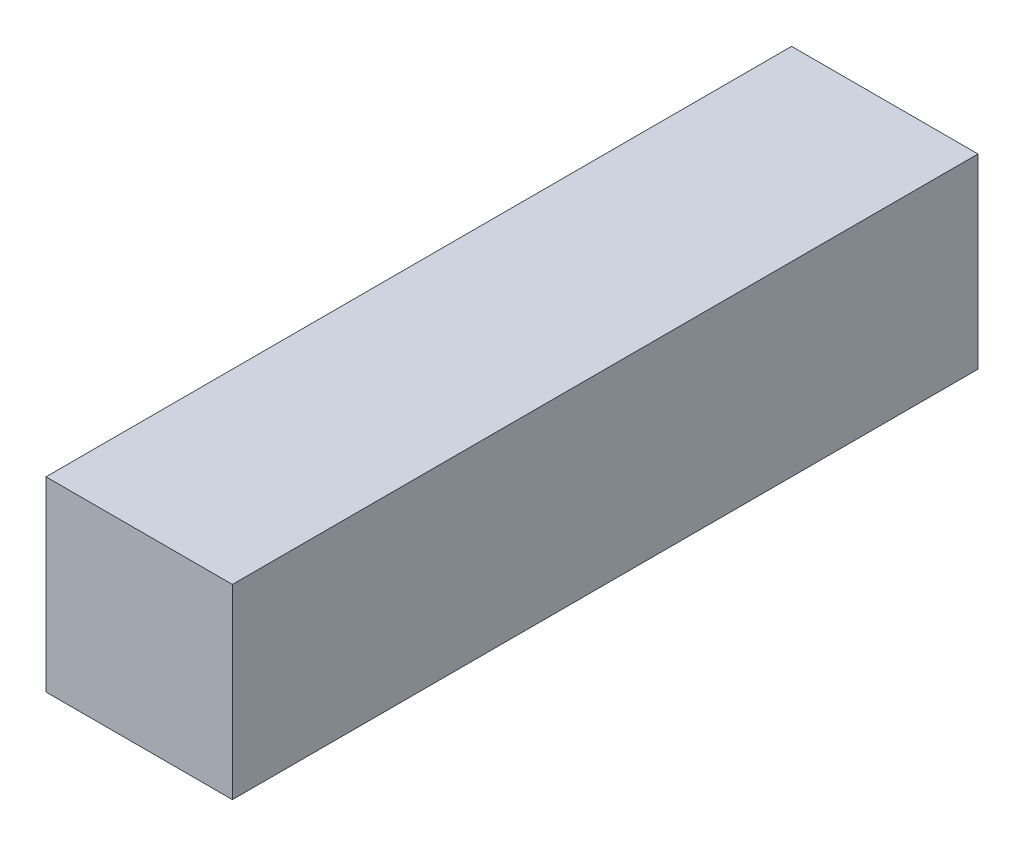
ISO-10303-21;
HEADER;
FILE_DESCRIPTION(('STEP AP214'),'2;1');
FILE_NAME('part.step','',(''),(''),'','','');
FILE_SCHEMA(('AUTOMOTIVE_DESIGN { 1 0 10303 214 1 1 1 1 }'));
ENDSEC;
DATA;
#1=APPLICATION_CONTEXT('core data for automotive mechanical design processes');
#2=APPLICATION_PROTOCOL_DEFINITION('international standard','automotive_design',2000,#1);
#3=PRODUCT_CONTEXT('',#1,'mechanical');
#4=PRODUCT('Part','Part','',(#3));
#5=PRODUCT_RELATED_PRODUCT_CATEGORY('part','',(#4));
#6=PRODUCT_DEFINITION_FORMATION('','',#4);
#7=PRODUCT_DEFINITION_CONTEXT('part definition',#1,'design');
#8=PRODUCT_DEFINITION('design','',#6,#7);
#9=PRODUCT_DEFINITION_SHAPE('','',#8);
#10=(LENGTH_UNIT() NAMED_UNIT(*) SI_UNIT(.MILLI.,.METRE.));
#11=(NAMED_UNIT(*) PLANE_ANGLE_UNIT() SI_UNIT($,.RADIAN.));
#12=(NAMED_UNIT(*) SI_UNIT($,.STERADIAN.) SOLID_ANGLE_UNIT());
#13=UNCERTAINTY_MEASURE_WITH_UNIT(LENGTH_MEASURE(1.E-05),#10,'distance_accuracy_value','');
#14=(GEOMETRIC_REPRESENTATION_CONTEXT(3) GLOBAL_UNCERTAINTY_ASSIGNED_CONTEXT((#13)) GLOBAL_UNIT_ASSIGNED_CONTEXT((#10,
#11,#12)) REPRESENTATION_CONTEXT('',''));
#15=CARTESIAN_POINT('',(0.,0.,0.));
#16=DIRECTION('',(0.,0.,1.));
#17=DIRECTION('',(1.,0.,0.));
#18=AXIS2_PLACEMENT_3D('',#15,#16,#17);
#19=CARTESIAN_POINT('',(-2500.,5000.,-10000.));
#20=DIRECTION('',(0.,0.,-1.));
#21=DIRECTION('',(-1.,0.,0.));
#22=AXIS2_PLACEMENT_3D('',#19,#20,#21);
#23=PLANE('',#22);
#24=DIRECTION('',(1.,0.,0.));
#25=VECTOR('',#24,1.);
#26=CARTESIAN_POINT('',(-2500.,0.,-10000.));
#27=LINE('',#26,#25);
#28=CARTESIAN_POINT('',(-2500.,0.,-10000.));
#29=VERTEX_POINT('',#28);
#30=CARTESIAN_POINT('',(2500.,0.,-10000.));
#31=VERTEX_POINT('',#30);
#32=EDGE_CURVE('E97',#29,#31,#27,.T.);
#33=ORIENTED_EDGE('',*,*,#32,.F.);
#34=DIRECTION('',(0.,-1.,0.));
#35=VECTOR('',#34,1.);
#36=CARTESIAN_POINT('',(-2500.,5000.,-10000.));
#37=LINE('',#36,#35);
#38=CARTESIAN_POINT('',(-2500.,5000.,-10000.));
#39=VERTEX_POINT('',#38);
#40=EDGE_CURVE('E11',#39,#29,#37,.T.);
#41=ORIENTED_EDGE('',*,*,#40,.F.);
#42=DIRECTION('',(1.,0.,0.));
#43=VECTOR('',#42,1.);
#44=CARTESIAN_POINT('',(-2500.,5000.,-10000.));
#45=LINE('',#44,#43);
#46=CARTESIAN_POINT('',(2500.,5000.,-10000.));
#47=VERTEX_POINT('',#46);
#48=EDGE_CURVE('E91',#39,#47,#45,.T.);
#49=ORIENTED_EDGE('',*,*,#48,.T.);
#50=DIRECTION('',(0.,-1.,0.));
#51=VECTOR('',#50,1.);
#52=CARTESIAN_POINT('',(2500.,5000.,-10000.));
#53=LINE('',#52,#51);
#54=EDGE_CURVE('E36',#47,#31,#53,.T.);
#55=ORIENTED_EDGE('',*,*,#54,.T.);
#56=EDGE_LOOP('',(#33,#41,#49,#55));
#57=FACE_BOUND('',#56,.T.);
#58=ADVANCED_FACE('F33',(#57),#23,.T.);
#59=CARTESIAN_POINT('',(-2500.,5000.,10000.));
#60=DIRECTION('',(-1.,0.,0.));
#61=DIRECTION('',(0.,0.,1.));
#62=AXIS2_PLACEMENT_3D('',#59,#60,#61);
#63=PLANE('',#62);
#64=DIRECTION('',(0.,0.,-1.));
#65=VECTOR('',#64,1.);
#66=CARTESIAN_POINT('',(-2500.,0.,10000.));
#67=LINE('',#66,#65);
#68=CARTESIAN_POINT('',(-2500.,0.,10000.));
#69=VERTEX_POINT('',#68);
#70=EDGE_CURVE('E93',#69,#29,#67,.T.);
#71=ORIENTED_EDGE('',*,*,#70,.F.);
#72=DIRECTION('',(0.,-1.,0.));
#73=VECTOR('',#72,1.);
#74=CARTESIAN_POINT('',(-2500.,5000.,10000.));
#75=LINE('',#74,#73);
#76=CARTESIAN_POINT('',(-2500.,5000.,10000.));
#77=VERTEX_POINT('',#76);
#78=EDGE_CURVE('E42',#77,#69,#75,.T.);
#79=ORIENTED_EDGE('',*,*,#78,.F.);
#80=DIRECTION('',(0.,0.,-1.));
#81=VECTOR('',#80,1.);
#82=CARTESIAN_POINT('',(-2500.,5000.,10000.));
#83=LINE('',#82,#81);
#84=EDGE_CURVE('E81',#77,#39,#83,.T.);
#85=ORIENTED_EDGE('',*,*,#84,.T.);
#86=ORIENTED_EDGE('',*,*,#40,.T.);
#87=EDGE_LOOP('',(#71,#79,#85,#86));
#88=FACE_BOUND('',#87,.T.);
#89=ADVANCED_FACE('F107',(#88),#63,.T.);
#90=CARTESIAN_POINT('',(-2500.,5000.,10000.));
#91=DIRECTION('',(0.,0.,-1.));
#92=DIRECTION('',(-1.,0.,0.));
#93=AXIS2_PLACEMENT_3D('',#90,#91,#92);
#94=PLANE('',#93);
#95=DIRECTION('',(1.,0.,0.));
#96=VECTOR('',#95,1.);
#97=CARTESIAN_POINT('',(-2500.,0.,10000.));
#98=LINE('',#97,#96);
#99=CARTESIAN_POINT('',(2500.,0.,10000.));
#100=VERTEX_POINT('',#99);
#101=EDGE_CURVE('E86',#69,#100,#98,.T.);
#102=ORIENTED_EDGE('',*,*,#101,.T.);
#103=DIRECTION('',(0.,-1.,0.));
#104=VECTOR('',#103,1.);
#105=CARTESIAN_POINT('',(2500.,5000.,10000.));
#106=LINE('',#105,#104);
#107=CARTESIAN_POINT('',(2500.,5000.,10000.));
#108=VERTEX_POINT('',#107);
#109=EDGE_CURVE('E84',#108,#100,#106,.T.);
#110=ORIENTED_EDGE('',*,*,#109,.F.);
#111=DIRECTION('',(1.,0.,0.));
#112=VECTOR('',#111,1.);
#113=CARTESIAN_POINT('',(-2500.,5000.,10000.));
#114=LINE('',#113,#112);
#115=EDGE_CURVE('E78',#77,#108,#114,.T.);
#116=ORIENTED_EDGE('',*,*,#115,.F.);
#117=ORIENTED_EDGE('',*,*,#78,.T.);
#118=EDGE_LOOP('',(#102,#110,#116,#117));
#119=FACE_BOUND('',#118,.T.);
#120=ADVANCED_FACE('F85',(#119),#94,.F.);
#121=CARTESIAN_POINT('',(2500.,5000.,10000.));
#122=DIRECTION('',(-1.,0.,0.));
#123=DIRECTION('',(0.,0.,1.));
#124=AXIS2_PLACEMENT_3D('',#121,#122,#123);
#125=PLANE('',#124);
#126=DIRECTION('',(0.,0.,-1.));
#127=VECTOR('',#126,1.);
#128=CARTESIAN_POINT('',(2500.,0.,10000.));
#129=LINE('',#128,#127);
#130=EDGE_CURVE('E100',#100,#31,#129,.T.);
#131=ORIENTED_EDGE('',*,*,#130,.T.);
#132=ORIENTED_EDGE('',*,*,#54,.F.);
#133=DIRECTION('',(0.,0.,-1.));
#134=VECTOR('',#133,1.);
#135=CARTESIAN_POINT('',(2500.,5000.,10000.));
#136=LINE('',#135,#134);
#137=EDGE_CURVE('E75',#108,#47,#136,.T.);
#138=ORIENTED_EDGE('',*,*,#137,.F.);
#139=ORIENTED_EDGE('',*,*,#109,.T.);
#140=EDGE_LOOP('',(#131,#132,#138,#139));
#141=FACE_BOUND('',#140,.T.);
#142=ADVANCED_FACE('F90',(#141),#125,.F.);
#143=CARTESIAN_POINT('',(0.,5000.,0.));
#144=DIRECTION('',(0.,1.,0.));
#145=DIRECTION('',(0.,0.,1.));
#146=AXIS2_PLACEMENT_3D('',#143,#144,#145);
#147=PLANE('',#146);
#148=ORIENTED_EDGE('',*,*,#48,.F.);
#149=ORIENTED_EDGE('',*,*,#84,.F.);
#150=ORIENTED_EDGE('',*,*,#115,.T.);
#151=ORIENTED_EDGE('',*,*,#137,.T.);
#152=EDGE_LOOP('',(#148,#149,#150,#151));
#153=FACE_BOUND('',#152,.T.);
#154=ADVANCED_FACE('F80',(#153),#147,.T.);
#155=CARTESIAN_POINT('',(0.,0.,0.));
#156=DIRECTION('',(0.,1.,0.));
#157=DIRECTION('',(0.,0.,1.));
#158=AXIS2_PLACEMENT_3D('',#155,#156,#157);
#159=PLANE('',#158);
#160=ORIENTED_EDGE('',*,*,#32,.T.);
#161=ORIENTED_EDGE('',*,*,#130,.F.);
#162=ORIENTED_EDGE('',*,*,#101,.F.);
#163=ORIENTED_EDGE('',*,*,#70,.T.);
#164=EDGE_LOOP('',(#160,#161,#162,#163));
#165=FACE_BOUND('',#164,.T.);
#166=ADVANCED_FACE('F106',(#165),#159,.F.);
#167=CLOSED_SHELL('',(#58,#89,#120,#142,#154,#166));
#168=MANIFOLD_SOLID_BREP('B2',#167);
#169=ADVANCED_BREP_SHAPE_REPRESENTATION('',(#18,#168),#14);
#170=SHAPE_DEFINITION_REPRESENTATION(#9,#169);
ENDSEC;
END-ISO-10303-21;
